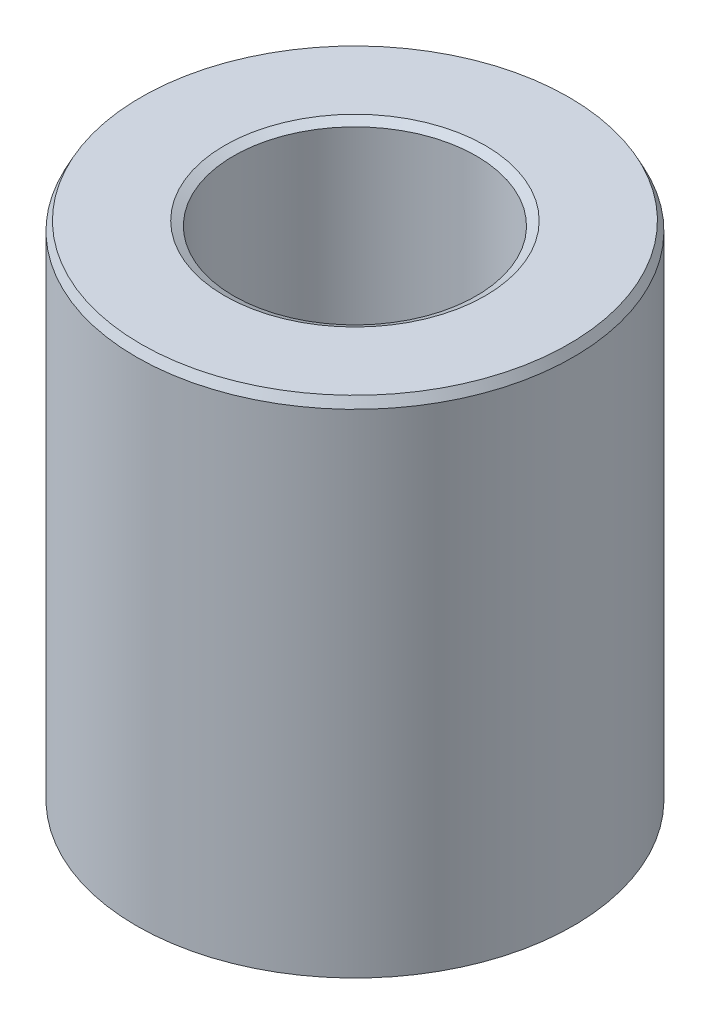
ISO-10303-21;
HEADER;
FILE_DESCRIPTION(('STEP AP214'),'2;1');
FILE_NAME('part.step','',(''),(''),'','','');
FILE_SCHEMA(('AUTOMOTIVE_DESIGN { 1 0 10303 214 1 1 1 1 }'));
ENDSEC;
DATA;
#1=APPLICATION_CONTEXT('core data for automotive mechanical design processes');
#2=APPLICATION_PROTOCOL_DEFINITION('international standard','automotive_design',2000,#1);
#3=PRODUCT_CONTEXT('',#1,'mechanical');
#4=PRODUCT('Part','Part','',(#3));
#5=PRODUCT_RELATED_PRODUCT_CATEGORY('part','',(#4));
#6=PRODUCT_DEFINITION_FORMATION('','',#4);
#7=PRODUCT_DEFINITION_CONTEXT('part definition',#1,'design');
#8=PRODUCT_DEFINITION('design','',#6,#7);
#9=PRODUCT_DEFINITION_SHAPE('','',#8);
#10=(LENGTH_UNIT() NAMED_UNIT(*) SI_UNIT(.MILLI.,.METRE.));
#11=(NAMED_UNIT(*) PLANE_ANGLE_UNIT() SI_UNIT($,.RADIAN.));
#12=(NAMED_UNIT(*) SI_UNIT($,.STERADIAN.) SOLID_ANGLE_UNIT());
#13=UNCERTAINTY_MEASURE_WITH_UNIT(LENGTH_MEASURE(1.E-05),#10,'distance_accuracy_value','');
#14=(GEOMETRIC_REPRESENTATION_CONTEXT(3) GLOBAL_UNCERTAINTY_ASSIGNED_CONTEXT((#13)) GLOBAL_UNIT_ASSIGNED_CONTEXT((#10,
#11,#12)) REPRESENTATION_CONTEXT('',''));
#15=CARTESIAN_POINT('',(0.,0.,0.));
#16=DIRECTION('',(0.,0.,1.));
#17=DIRECTION('',(1.,0.,0.));
#18=AXIS2_PLACEMENT_3D('',#15,#16,#17);
#19=CARTESIAN_POINT('',(0.,69.4827987197199,0.));
#20=DIRECTION('',(0.,-1.,0.));
#21=DIRECTION('',(0.,0.,-1.));
#22=AXIS2_PLACEMENT_3D('',#19,#20,#21);
#23=CYLINDRICAL_SURFACE('',#22,30.);
#24=CARTESIAN_POINT('',(0.,0.625856387293344,0.));
#25=DIRECTION('',(0.,1.,0.));
#26=DIRECTION('',(0.,0.,1.));
#27=AXIS2_PLACEMENT_3D('',#24,#25,#26);
#28=CIRCLE('',#27,30.);
#29=CARTESIAN_POINT('',(0.,0.625856387293344,30.));
#30=VERTEX_POINT('',#29);
#31=EDGE_CURVE('E10',#30,#30,#28,.T.);
#32=ORIENTED_EDGE('',*,*,#31,.T.);
#33=EDGE_LOOP('',(#32));
#34=FACE_BOUND('',#33,.T.);
#35=CARTESIAN_POINT('',(0.,68.2533567580921,0.));
#36=DIRECTION('',(0.,1.,0.));
#37=DIRECTION('',(0.,0.,1.));
#38=AXIS2_PLACEMENT_3D('',#35,#36,#37);
#39=CIRCLE('',#38,30.);
#40=CARTESIAN_POINT('',(0.,68.2533567580921,30.));
#41=VERTEX_POINT('',#40);
#42=EDGE_CURVE('E50',#41,#41,#39,.F.);
#43=ORIENTED_EDGE('',*,*,#42,.T.);
#44=EDGE_LOOP('',(#43));
#45=FACE_BOUND('',#44,.T.);
#46=ADVANCED_FACE('F39',(#34,#45),#23,.T.);
#47=CARTESIAN_POINT('',(0.,69.4827987197199,0.));
#48=DIRECTION('',(0.,1.,0.));
#49=DIRECTION('',(0.,0.,1.));
#50=AXIS2_PLACEMENT_3D('',#47,#48,#49);
#51=PLANE('',#50);
#52=CARTESIAN_POINT('',(0.,69.4827987197199,0.));
#53=DIRECTION('',(0.,1.,0.));
#54=DIRECTION('',(0.,0.,1.));
#55=AXIS2_PLACEMENT_3D('',#52,#53,#54);
#56=CIRCLE('',#55,17.8906782310495);
#57=CARTESIAN_POINT('',(0.,69.4827987197199,17.8906782310495));
#58=VERTEX_POINT('',#57);
#59=EDGE_CURVE('E58',#58,#58,#56,.F.);
#60=ORIENTED_EDGE('',*,*,#59,.T.);
#61=EDGE_LOOP('',(#60));
#62=FACE_BOUND('',#61,.T.);
#63=CARTESIAN_POINT('',(0.,69.4827987197199,0.));
#64=DIRECTION('',(0.,1.,0.));
#65=DIRECTION('',(0.,0.,1.));
#66=AXIS2_PLACEMENT_3D('',#63,#64,#65);
#67=CIRCLE('',#66,29.3741436127067);
#68=CARTESIAN_POINT('',(0.,69.4827987197199,29.3741436127067));
#69=VERTEX_POINT('',#68);
#70=EDGE_CURVE('E61',#69,#69,#67,.T.);
#71=ORIENTED_EDGE('',*,*,#70,.T.);
#72=EDGE_LOOP('',(#71));
#73=FACE_BOUND('',#72,.T.);
#74=ADVANCED_FACE('F88',(#62,#73),#51,.T.);
#75=CARTESIAN_POINT('',(0.,0.,0.));
#76=DIRECTION('',(0.,1.,0.));
#77=DIRECTION('',(0.,0.,1.));
#78=AXIS2_PLACEMENT_3D('',#75,#76,#77);
#79=PLANE('',#78);
#80=CARTESIAN_POINT('',(0.,0.,0.));
#81=DIRECTION('',(0.,1.,0.));
#82=DIRECTION('',(0.,0.,1.));
#83=AXIS2_PLACEMENT_3D('',#80,#81,#82);
#84=CIRCLE('',#83,17.287092656715);
#85=CARTESIAN_POINT('',(0.,0.,17.287092656715));
#86=VERTEX_POINT('',#85);
#87=EDGE_CURVE('E51',#86,#86,#84,.T.);
#88=ORIENTED_EDGE('',*,*,#87,.T.);
#89=EDGE_LOOP('',(#88));
#90=FACE_BOUND('',#89,.T.);
#91=CARTESIAN_POINT('',(0.,0.,0.));
#92=DIRECTION('',(0.,1.,0.));
#93=DIRECTION('',(0.,0.,1.));
#94=AXIS2_PLACEMENT_3D('',#91,#92,#93);
#95=CIRCLE('',#94,28.7705580383721);
#96=CARTESIAN_POINT('',(0.,0.,28.7705580383721));
#97=VERTEX_POINT('',#96);
#98=EDGE_CURVE('E54',#97,#97,#95,.F.);
#99=ORIENTED_EDGE('',*,*,#98,.T.);
#100=EDGE_LOOP('',(#99));
#101=FACE_BOUND('',#100,.T.);
#102=ADVANCED_FACE('F83',(#90,#101),#79,.F.);
#103=CARTESIAN_POINT('',(0.,69.4827987197199,0.));
#104=DIRECTION('',(0.,-1.,0.));
#105=DIRECTION('',(0.,0.,-1.));
#106=AXIS2_PLACEMENT_3D('',#103,#104,#105);
#107=CYLINDRICAL_SURFACE('',#106,16.6612362694217);
#108=CARTESIAN_POINT('',(0.,68.8569423324266,0.));
#109=DIRECTION('',(0.,1.,0.));
#110=DIRECTION('',(0.,0.,1.));
#111=AXIS2_PLACEMENT_3D('',#108,#109,#110);
#112=CIRCLE('',#111,16.6612362694217);
#113=CARTESIAN_POINT('',(0.,68.8569423324266,16.6612362694217));
#114=VERTEX_POINT('',#113);
#115=EDGE_CURVE('E67',#114,#114,#112,.T.);
#116=ORIENTED_EDGE('',*,*,#115,.T.);
#117=EDGE_LOOP('',(#116));
#118=FACE_BOUND('',#117,.T.);
#119=CARTESIAN_POINT('',(0.,1.22944196162791,0.));
#120=DIRECTION('',(0.,1.,0.));
#121=DIRECTION('',(0.,0.,1.));
#122=AXIS2_PLACEMENT_3D('',#119,#120,#121);
#123=CIRCLE('',#122,16.6612362694217);
#124=CARTESIAN_POINT('',(0.,1.22944196162791,16.6612362694217));
#125=VERTEX_POINT('',#124);
#126=EDGE_CURVE('E69',#125,#125,#123,.F.);
#127=ORIENTED_EDGE('',*,*,#126,.T.);
#128=EDGE_LOOP('',(#127));
#129=FACE_BOUND('',#128,.T.);
#130=ADVANCED_FACE('F71',(#118,#129),#107,.F.);
#131=CARTESIAN_POINT('',(0.,68.8569423324266,0.));
#132=DIRECTION('',(0.,1.,0.));
#133=DIRECTION('',(0.,0.,1.));
#134=AXIS2_PLACEMENT_3D('',#131,#132,#133);
#135=CONICAL_SURFACE('',#134,16.6612362694217,1.09992917132229);
#136=ORIENTED_EDGE('',*,*,#59,.F.);
#137=EDGE_LOOP('',(#136));
#138=FACE_BOUND('',#137,.T.);
#139=ORIENTED_EDGE('',*,*,#115,.F.);
#140=EDGE_LOOP('',(#139));
#141=FACE_BOUND('',#140,.T.);
#142=ADVANCED_FACE('F77',(#138,#141),#135,.F.);
#143=CARTESIAN_POINT('',(0.,0.,0.));
#144=DIRECTION('',(0.,-1.,0.));
#145=DIRECTION('',(0.,0.,-1.));
#146=AXIS2_PLACEMENT_3D('',#143,#144,#145);
#147=CONICAL_SURFACE('',#146,17.287092656715,0.470867155472599);
#148=ORIENTED_EDGE('',*,*,#126,.F.);
#149=EDGE_LOOP('',(#148));
#150=FACE_BOUND('',#149,.T.);
#151=ORIENTED_EDGE('',*,*,#87,.F.);
#152=EDGE_LOOP('',(#151));
#153=FACE_BOUND('',#152,.T.);
#154=ADVANCED_FACE('F73',(#150,#153),#147,.F.);
#155=CARTESIAN_POINT('',(0.,0.625856387293344,0.));
#156=DIRECTION('',(0.,1.,0.));
#157=DIRECTION('',(0.,0.,1.));
#158=AXIS2_PLACEMENT_3D('',#155,#156,#157);
#159=CONICAL_SURFACE('',#158,30.,1.09992917132229);
#160=ORIENTED_EDGE('',*,*,#98,.F.);
#161=EDGE_LOOP('',(#160));
#162=FACE_BOUND('',#161,.T.);
#163=ORIENTED_EDGE('',*,*,#31,.F.);
#164=EDGE_LOOP('',(#163));
#165=FACE_BOUND('',#164,.T.);
#166=ADVANCED_FACE('F76',(#162,#165),#159,.T.);
#167=CARTESIAN_POINT('',(0.,69.4827987197199,0.));
#168=DIRECTION('',(0.,-1.,0.));
#169=DIRECTION('',(0.,0.,-1.));
#170=AXIS2_PLACEMENT_3D('',#167,#168,#169);
#171=CONICAL_SURFACE('',#170,29.3741436127067,0.470867155472597);
#172=ORIENTED_EDGE('',*,*,#42,.F.);
#173=EDGE_LOOP('',(#172));
#174=FACE_BOUND('',#173,.T.);
#175=ORIENTED_EDGE('',*,*,#70,.F.);
#176=EDGE_LOOP('',(#175));
#177=FACE_BOUND('',#176,.T.);
#178=ADVANCED_FACE('F45',(#174,#177),#171,.T.);
#179=CLOSED_SHELL('',(#46,#74,#102,#130,#142,#154,#166,#178));
#180=MANIFOLD_SOLID_BREP('B2',#179);
#181=ADVANCED_BREP_SHAPE_REPRESENTATION('',(#18,#180),#14);
#182=SHAPE_DEFINITION_REPRESENTATION(#9,#181);
ENDSEC;
END-ISO-10303-21;
